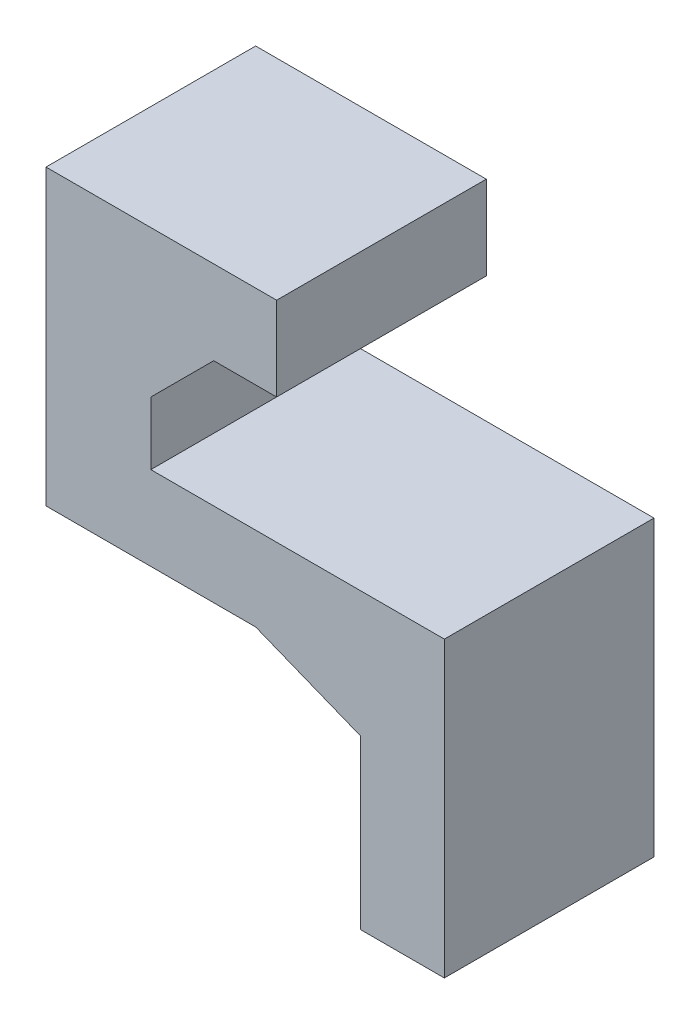
ISO-10303-21;
HEADER;
FILE_DESCRIPTION(('STEP AP214'),'2;1');
FILE_NAME('part.step','',(''),(''),'','','');
FILE_SCHEMA(('AUTOMOTIVE_DESIGN { 1 0 10303 214 1 1 1 1 }'));
ENDSEC;
DATA;
#1=APPLICATION_CONTEXT('core data for automotive mechanical design processes');
#2=APPLICATION_PROTOCOL_DEFINITION('international standard','automotive_design',2000,#1);
#3=PRODUCT_CONTEXT('',#1,'mechanical');
#4=PRODUCT('Part','Part','',(#3));
#5=PRODUCT_RELATED_PRODUCT_CATEGORY('part','',(#4));
#6=PRODUCT_DEFINITION_FORMATION('','',#4);
#7=PRODUCT_DEFINITION_CONTEXT('part definition',#1,'design');
#8=PRODUCT_DEFINITION('design','',#6,#7);
#9=PRODUCT_DEFINITION_SHAPE('','',#8);
#10=(LENGTH_UNIT() NAMED_UNIT(*) SI_UNIT(.MILLI.,.METRE.));
#11=(NAMED_UNIT(*) PLANE_ANGLE_UNIT() SI_UNIT($,.RADIAN.));
#12=(NAMED_UNIT(*) SI_UNIT($,.STERADIAN.) SOLID_ANGLE_UNIT());
#13=UNCERTAINTY_MEASURE_WITH_UNIT(LENGTH_MEASURE(1.E-05),#10,'distance_accuracy_value','');
#14=(GEOMETRIC_REPRESENTATION_CONTEXT(3) GLOBAL_UNCERTAINTY_ASSIGNED_CONTEXT((#13)) GLOBAL_UNIT_ASSIGNED_CONTEXT((#10,
#11,#12)) REPRESENTATION_CONTEXT('',''));
#15=CARTESIAN_POINT('',(0.,0.,0.));
#16=DIRECTION('',(0.,0.,1.));
#17=DIRECTION('',(1.,0.,0.));
#18=AXIS2_PLACEMENT_3D('',#15,#16,#17);
#19=CARTESIAN_POINT('',(-40.,120.,-50.));
#20=DIRECTION('',(-1.,0.,0.));
#21=DIRECTION('',(0.,-1.,0.));
#22=AXIS2_PLACEMENT_3D('',#19,#20,#21);
#23=PLANE('',#22);
#24=DIRECTION('',(0.,-1.,0.));
#25=VECTOR('',#24,1.);
#26=CARTESIAN_POINT('',(-40.,120.,0.));
#27=LINE('',#26,#25);
#28=CARTESIAN_POINT('',(-40.,120.,0.));
#29=VERTEX_POINT('',#28);
#30=CARTESIAN_POINT('',(-40.,100.,0.));
#31=VERTEX_POINT('',#30);
#32=EDGE_CURVE('E140',#29,#31,#27,.T.);
#33=ORIENTED_EDGE('',*,*,#32,.T.);
#34=DIRECTION('',(0.,0.,1.));
#35=VECTOR('',#34,1.);
#36=CARTESIAN_POINT('',(-40.,100.,-50.));
#37=LINE('',#36,#35);
#38=CARTESIAN_POINT('',(-40.,100.,-50.));
#39=VERTEX_POINT('',#38);
#40=EDGE_CURVE('E11',#39,#31,#37,.T.);
#41=ORIENTED_EDGE('',*,*,#40,.F.);
#42=DIRECTION('',(0.,-1.,0.));
#43=VECTOR('',#42,1.);
#44=CARTESIAN_POINT('',(-40.,120.,-50.));
#45=LINE('',#44,#43);
#46=CARTESIAN_POINT('',(-40.,120.,-50.));
#47=VERTEX_POINT('',#46);
#48=EDGE_CURVE('E128',#47,#39,#45,.T.);
#49=ORIENTED_EDGE('',*,*,#48,.F.);
#50=DIRECTION('',(0.,0.,1.));
#51=VECTOR('',#50,1.);
#52=CARTESIAN_POINT('',(-40.,120.,-50.));
#53=LINE('',#52,#51);
#54=EDGE_CURVE('E141',#47,#29,#53,.T.);
#55=ORIENTED_EDGE('',*,*,#54,.T.);
#56=EDGE_LOOP('',(#33,#41,#49,#55));
#57=FACE_BOUND('',#56,.T.);
#58=ADVANCED_FACE('F35',(#57),#23,.F.);
#59=CARTESIAN_POINT('',(-40.,100.,-50.));
#60=DIRECTION('',(0.,1.,0.));
#61=DIRECTION('',(0.,0.,1.));
#62=AXIS2_PLACEMENT_3D('',#59,#60,#61);
#63=PLANE('',#62);
#64=DIRECTION('',(-1.,0.,0.));
#65=VECTOR('',#64,1.);
#66=CARTESIAN_POINT('',(-40.,100.,0.));
#67=LINE('',#66,#65);
#68=CARTESIAN_POINT('',(-55.,100.,0.));
#69=VERTEX_POINT('',#68);
#70=EDGE_CURVE('E144',#31,#69,#67,.T.);
#71=ORIENTED_EDGE('',*,*,#70,.T.);
#72=DIRECTION('',(0.,0.,1.));
#73=VECTOR('',#72,1.);
#74=CARTESIAN_POINT('',(-55.,100.,-50.));
#75=LINE('',#74,#73);
#76=CARTESIAN_POINT('',(-55.,100.,-50.));
#77=VERTEX_POINT('',#76);
#78=EDGE_CURVE('E57',#77,#69,#75,.T.);
#79=ORIENTED_EDGE('',*,*,#78,.F.);
#80=DIRECTION('',(-1.,0.,0.));
#81=VECTOR('',#80,1.);
#82=CARTESIAN_POINT('',(-40.,100.,-50.));
#83=LINE('',#82,#81);
#84=EDGE_CURVE('E120',#39,#77,#83,.T.);
#85=ORIENTED_EDGE('',*,*,#84,.F.);
#86=ORIENTED_EDGE('',*,*,#40,.T.);
#87=EDGE_LOOP('',(#71,#79,#85,#86));
#88=FACE_BOUND('',#87,.T.);
#89=ADVANCED_FACE('F122',(#88),#63,.F.);
#90=CARTESIAN_POINT('',(-70.,100.,-50.));
#91=DIRECTION('',(-1.,0.,0.));
#92=DIRECTION('',(0.,0.,1.));
#93=AXIS2_PLACEMENT_3D('',#90,#91,#92);
#94=PLANE('',#93);
#95=DIRECTION('',(0.,-1.,0.));
#96=VECTOR('',#95,1.);
#97=CARTESIAN_POINT('',(-70.,100.,-50.));
#98=LINE('',#97,#96);
#99=CARTESIAN_POINT('',(-70.,84.9999999999999,-50.));
#100=VERTEX_POINT('',#99);
#101=CARTESIAN_POINT('',(-70.,70.,-50.));
#102=VERTEX_POINT('',#101);
#103=EDGE_CURVE('E49',#100,#102,#98,.T.);
#104=ORIENTED_EDGE('',*,*,#103,.F.);
#105=DIRECTION('',(0.,0.,1.));
#106=VECTOR('',#105,1.);
#107=CARTESIAN_POINT('',(-70.,85.,-50.));
#108=LINE('',#107,#106);
#109=CARTESIAN_POINT('',(-70.,84.9999999999999,0.));
#110=VERTEX_POINT('',#109);
#111=EDGE_CURVE('E239',#100,#110,#108,.T.);
#112=ORIENTED_EDGE('',*,*,#111,.T.);
#113=DIRECTION('',(0.,-1.,0.));
#114=VECTOR('',#113,1.);
#115=CARTESIAN_POINT('',(-70.,100.,0.));
#116=LINE('',#115,#114);
#117=CARTESIAN_POINT('',(-70.,70.,0.));
#118=VERTEX_POINT('',#117);
#119=EDGE_CURVE('E147',#110,#118,#116,.T.);
#120=ORIENTED_EDGE('',*,*,#119,.T.);
#121=DIRECTION('',(0.,0.,1.));
#122=VECTOR('',#121,1.);
#123=CARTESIAN_POINT('',(-70.,70.,-50.));
#124=LINE('',#123,#122);
#125=EDGE_CURVE('E42',#102,#118,#124,.T.);
#126=ORIENTED_EDGE('',*,*,#125,.F.);
#127=EDGE_LOOP('',(#104,#112,#120,#126));
#128=FACE_BOUND('',#127,.T.);
#129=ADVANCED_FACE('F250',(#128),#94,.F.);
#130=CARTESIAN_POINT('',(-70.,70.,-50.));
#131=DIRECTION('',(0.,-1.,0.));
#132=DIRECTION('',(0.,0.,-1.));
#133=AXIS2_PLACEMENT_3D('',#130,#131,#132);
#134=PLANE('',#133);
#135=DIRECTION('',(1.,0.,0.));
#136=VECTOR('',#135,1.);
#137=CARTESIAN_POINT('',(-70.,70.,0.));
#138=LINE('',#137,#136);
#139=CARTESIAN_POINT('',(0.,70.,0.));
#140=VERTEX_POINT('',#139);
#141=EDGE_CURVE('E156',#118,#140,#138,.T.);
#142=ORIENTED_EDGE('',*,*,#141,.T.);
#143=DIRECTION('',(0.,0.,1.));
#144=VECTOR('',#143,1.);
#145=CARTESIAN_POINT('',(0.,70.,-50.));
#146=LINE('',#145,#144);
#147=CARTESIAN_POINT('',(0.,70.,-50.));
#148=VERTEX_POINT('',#147);
#149=EDGE_CURVE('E182',#148,#140,#146,.T.);
#150=ORIENTED_EDGE('',*,*,#149,.F.);
#151=DIRECTION('',(1.,0.,0.));
#152=VECTOR('',#151,1.);
#153=CARTESIAN_POINT('',(-70.,70.,-50.));
#154=LINE('',#153,#152);
#155=EDGE_CURVE('E190',#102,#148,#154,.T.);
#156=ORIENTED_EDGE('',*,*,#155,.F.);
#157=ORIENTED_EDGE('',*,*,#125,.T.);
#158=EDGE_LOOP('',(#142,#150,#156,#157));
#159=FACE_BOUND('',#158,.T.);
#160=ADVANCED_FACE('F188',(#159),#134,.F.);
#161=CARTESIAN_POINT('',(0.,70.,-50.));
#162=DIRECTION('',(-1.,0.,0.));
#163=DIRECTION('',(0.,-1.,0.));
#164=AXIS2_PLACEMENT_3D('',#161,#162,#163);
#165=PLANE('',#164);
#166=DIRECTION('',(0.,-1.,0.));
#167=VECTOR('',#166,1.);
#168=CARTESIAN_POINT('',(0.,70.,0.));
#169=LINE('',#168,#167);
#170=CARTESIAN_POINT('',(0.,0.,0.));
#171=VERTEX_POINT('',#170);
#172=EDGE_CURVE('E158',#140,#171,#169,.T.);
#173=ORIENTED_EDGE('',*,*,#172,.T.);
#174=DIRECTION('',(0.,0.,1.));
#175=VECTOR('',#174,1.);
#176=CARTESIAN_POINT('',(0.,0.,-50.));
#177=LINE('',#176,#175);
#178=CARTESIAN_POINT('',(0.,0.,-50.));
#179=VERTEX_POINT('',#178);
#180=EDGE_CURVE('E179',#179,#171,#177,.T.);
#181=ORIENTED_EDGE('',*,*,#180,.F.);
#182=DIRECTION('',(0.,-1.,0.));
#183=VECTOR('',#182,1.);
#184=CARTESIAN_POINT('',(0.,70.,-50.));
#185=LINE('',#184,#183);
#186=EDGE_CURVE('E210',#148,#179,#185,.T.);
#187=ORIENTED_EDGE('',*,*,#186,.F.);
#188=ORIENTED_EDGE('',*,*,#149,.T.);
#189=EDGE_LOOP('',(#173,#181,#187,#188));
#190=FACE_BOUND('',#189,.T.);
#191=ADVANCED_FACE('F200',(#190),#165,.F.);
#192=CARTESIAN_POINT('',(0.,0.,-50.));
#193=DIRECTION('',(0.,1.,0.));
#194=DIRECTION('',(0.,0.,1.));
#195=AXIS2_PLACEMENT_3D('',#192,#193,#194);
#196=PLANE('',#195);
#197=DIRECTION('',(-1.,0.,0.));
#198=VECTOR('',#197,1.);
#199=CARTESIAN_POINT('',(0.,0.,0.));
#200=LINE('',#199,#198);
#201=CARTESIAN_POINT('',(-20.,0.,0.));
#202=VERTEX_POINT('',#201);
#203=EDGE_CURVE('E160',#171,#202,#200,.T.);
#204=ORIENTED_EDGE('',*,*,#203,.T.);
#205=DIRECTION('',(0.,0.,1.));
#206=VECTOR('',#205,1.);
#207=CARTESIAN_POINT('',(-20.,0.,-50.));
#208=LINE('',#207,#206);
#209=CARTESIAN_POINT('',(-20.,0.,-50.));
#210=VERTEX_POINT('',#209);
#211=EDGE_CURVE('E176',#210,#202,#208,.T.);
#212=ORIENTED_EDGE('',*,*,#211,.F.);
#213=DIRECTION('',(-1.,0.,0.));
#214=VECTOR('',#213,1.);
#215=CARTESIAN_POINT('',(0.,0.,-50.));
#216=LINE('',#215,#214);
#217=EDGE_CURVE('E206',#179,#210,#216,.T.);
#218=ORIENTED_EDGE('',*,*,#217,.F.);
#219=ORIENTED_EDGE('',*,*,#180,.T.);
#220=EDGE_LOOP('',(#204,#212,#218,#219));
#221=FACE_BOUND('',#220,.T.);
#222=ADVANCED_FACE('F204',(#221),#196,.F.);
#223=CARTESIAN_POINT('',(-20.,0.,-50.));
#224=DIRECTION('',(1.,0.,0.));
#225=DIRECTION('',(0.,0.,-1.));
#226=AXIS2_PLACEMENT_3D('',#223,#224,#225);
#227=PLANE('',#226);
#228=DIRECTION('',(0.,1.,0.));
#229=VECTOR('',#228,1.);
#230=CARTESIAN_POINT('',(-20.,0.,0.));
#231=LINE('',#230,#229);
#232=CARTESIAN_POINT('',(-20.,40.,0.));
#233=VERTEX_POINT('',#232);
#234=EDGE_CURVE('E162',#202,#233,#231,.T.);
#235=ORIENTED_EDGE('',*,*,#234,.T.);
#236=DIRECTION('',(0.,0.,1.));
#237=VECTOR('',#236,1.);
#238=CARTESIAN_POINT('',(-20.,40.,-50.));
#239=LINE('',#238,#237);
#240=CARTESIAN_POINT('',(-20.,40.,-50.));
#241=VERTEX_POINT('',#240);
#242=EDGE_CURVE('E145',#241,#233,#239,.T.);
#243=ORIENTED_EDGE('',*,*,#242,.F.);
#244=DIRECTION('',(0.,1.,0.));
#245=VECTOR('',#244,1.);
#246=CARTESIAN_POINT('',(-20.,0.,-50.));
#247=LINE('',#246,#245);
#248=EDGE_CURVE('E209',#210,#241,#247,.T.);
#249=ORIENTED_EDGE('',*,*,#248,.F.);
#250=ORIENTED_EDGE('',*,*,#211,.T.);
#251=EDGE_LOOP('',(#235,#243,#249,#250));
#252=FACE_BOUND('',#251,.T.);
#253=ADVANCED_FACE('F316',(#252),#227,.F.);
#254=CARTESIAN_POINT('',(-20.,50.,-50.));
#255=DIRECTION('',(0.,1.,0.));
#256=DIRECTION('',(-1.,0.,0.));
#257=AXIS2_PLACEMENT_3D('',#254,#255,#256);
#258=PLANE('',#257);
#259=DIRECTION('',(-1.,0.,0.));
#260=VECTOR('',#259,1.);
#261=CARTESIAN_POINT('',(-20.,50.,-50.));
#262=LINE('',#261,#260);
#263=CARTESIAN_POINT('',(-45.0000000000001,50.,-50.));
#264=VERTEX_POINT('',#263);
#265=CARTESIAN_POINT('',(-95.,50.,-50.));
#266=VERTEX_POINT('',#265);
#267=EDGE_CURVE('E212',#264,#266,#262,.T.);
#268=ORIENTED_EDGE('',*,*,#267,.F.);
#269=DIRECTION('',(0.,0.,1.));
#270=VECTOR('',#269,1.);
#271=CARTESIAN_POINT('',(-45.,50.,-50.));
#272=LINE('',#271,#270);
#273=CARTESIAN_POINT('',(-45.0000000000001,50.,0.));
#274=VERTEX_POINT('',#273);
#275=EDGE_CURVE('E150',#264,#274,#272,.T.);
#276=ORIENTED_EDGE('',*,*,#275,.T.);
#277=DIRECTION('',(-1.,0.,0.));
#278=VECTOR('',#277,1.);
#279=CARTESIAN_POINT('',(-20.,50.,0.));
#280=LINE('',#279,#278);
#281=CARTESIAN_POINT('',(-95.,50.,0.));
#282=VERTEX_POINT('',#281);
#283=EDGE_CURVE('E164',#274,#282,#280,.T.);
#284=ORIENTED_EDGE('',*,*,#283,.T.);
#285=DIRECTION('',(0.,0.,1.));
#286=VECTOR('',#285,1.);
#287=CARTESIAN_POINT('',(-95.,50.,-50.));
#288=LINE('',#287,#286);
#289=EDGE_CURVE('E173',#266,#282,#288,.T.);
#290=ORIENTED_EDGE('',*,*,#289,.F.);
#291=EDGE_LOOP('',(#268,#276,#284,#290));
#292=FACE_BOUND('',#291,.T.);
#293=ADVANCED_FACE('F313',(#292),#258,.F.);
#294=CARTESIAN_POINT('',(-95.,50.,-50.));
#295=DIRECTION('',(1.,0.,0.));
#296=DIRECTION('',(0.,0.,-1.));
#297=AXIS2_PLACEMENT_3D('',#294,#295,#296);
#298=PLANE('',#297);
#299=DIRECTION('',(0.,1.,0.));
#300=VECTOR('',#299,1.);
#301=CARTESIAN_POINT('',(-95.,50.,0.));
#302=LINE('',#301,#300);
#303=CARTESIAN_POINT('',(-95.,120.,0.));
#304=VERTEX_POINT('',#303);
#305=EDGE_CURVE('E166',#282,#304,#302,.T.);
#306=ORIENTED_EDGE('',*,*,#305,.T.);
#307=DIRECTION('',(0.,0.,1.));
#308=VECTOR('',#307,1.);
#309=CARTESIAN_POINT('',(-95.,120.,-50.));
#310=LINE('',#309,#308);
#311=CARTESIAN_POINT('',(-95.,120.,-50.));
#312=VERTEX_POINT('',#311);
#313=EDGE_CURVE('E170',#312,#304,#310,.T.);
#314=ORIENTED_EDGE('',*,*,#313,.F.);
#315=DIRECTION('',(0.,1.,0.));
#316=VECTOR('',#315,1.);
#317=CARTESIAN_POINT('',(-95.,50.,-50.));
#318=LINE('',#317,#316);
#319=EDGE_CURVE('E217',#266,#312,#318,.T.);
#320=ORIENTED_EDGE('',*,*,#319,.F.);
#321=ORIENTED_EDGE('',*,*,#289,.T.);
#322=EDGE_LOOP('',(#306,#314,#320,#321));
#323=FACE_BOUND('',#322,.T.);
#324=ADVANCED_FACE('F223',(#323),#298,.F.);
#325=CARTESIAN_POINT('',(-95.,120.,-50.));
#326=DIRECTION('',(0.,-1.,0.));
#327=DIRECTION('',(0.,0.,-1.));
#328=AXIS2_PLACEMENT_3D('',#325,#326,#327);
#329=PLANE('',#328);
#330=DIRECTION('',(1.,0.,0.));
#331=VECTOR('',#330,1.);
#332=CARTESIAN_POINT('',(-95.,120.,0.));
#333=LINE('',#332,#331);
#334=EDGE_CURVE('E137',#304,#29,#333,.T.);
#335=ORIENTED_EDGE('',*,*,#334,.T.);
#336=ORIENTED_EDGE('',*,*,#54,.F.);
#337=DIRECTION('',(1.,0.,0.));
#338=VECTOR('',#337,1.);
#339=CARTESIAN_POINT('',(-95.,120.,-50.));
#340=LINE('',#339,#338);
#341=EDGE_CURVE('E133',#312,#47,#340,.T.);
#342=ORIENTED_EDGE('',*,*,#341,.F.);
#343=ORIENTED_EDGE('',*,*,#313,.T.);
#344=EDGE_LOOP('',(#335,#336,#342,#343));
#345=FACE_BOUND('',#344,.T.);
#346=ADVANCED_FACE('F226',(#345),#329,.F.);
#347=CARTESIAN_POINT('',(0.,0.,-50.));
#348=DIRECTION('',(0.,0.,-1.));
#349=DIRECTION('',(-1.,0.,0.));
#350=AXIS2_PLACEMENT_3D('',#347,#348,#349);
#351=PLANE('',#350);
#352=DIRECTION('',(0.707106781186548,0.707106781186548,0.));
#353=VECTOR('',#352,1.);
#354=CARTESIAN_POINT('',(-77.5,77.5,-50.));
#355=LINE('',#354,#353);
#356=EDGE_CURVE('E244',#100,#77,#355,.T.);
#357=ORIENTED_EDGE('',*,*,#356,.F.);
#358=ORIENTED_EDGE('',*,*,#103,.T.);
#359=ORIENTED_EDGE('',*,*,#155,.T.);
#360=ORIENTED_EDGE('',*,*,#186,.T.);
#361=ORIENTED_EDGE('',*,*,#217,.T.);
#362=ORIENTED_EDGE('',*,*,#248,.T.);
#363=DIRECTION('',(0.928476690885259,-0.371390676354103,0.));
#364=VECTOR('',#363,1.);
#365=CARTESIAN_POINT('',(-45.,50.,-50.));
#366=LINE('',#365,#364);
#367=EDGE_CURVE('E236',#264,#241,#366,.T.);
#368=ORIENTED_EDGE('',*,*,#367,.F.);
#369=ORIENTED_EDGE('',*,*,#267,.T.);
#370=ORIENTED_EDGE('',*,*,#319,.T.);
#371=ORIENTED_EDGE('',*,*,#341,.T.);
#372=ORIENTED_EDGE('',*,*,#48,.T.);
#373=ORIENTED_EDGE('',*,*,#84,.T.);
#374=EDGE_LOOP('',(#357,#358,#359,#360,#361,#362,#368,#369,#370,#371,#372,#373));
#375=FACE_BOUND('',#374,.T.);
#376=ADVANCED_FACE('F131',(#375),#351,.T.);
#377=CARTESIAN_POINT('',(0.,0.,0.));
#378=DIRECTION('',(0.,0.,-1.));
#379=DIRECTION('',(-1.,0.,0.));
#380=AXIS2_PLACEMENT_3D('',#377,#378,#379);
#381=PLANE('',#380);
#382=ORIENTED_EDGE('',*,*,#119,.F.);
#383=DIRECTION('',(0.707106781186548,0.707106781186548,0.));
#384=VECTOR('',#383,1.);
#385=CARTESIAN_POINT('',(-77.5,77.5,0.));
#386=LINE('',#385,#384);
#387=EDGE_CURVE('E246',#110,#69,#386,.T.);
#388=ORIENTED_EDGE('',*,*,#387,.T.);
#389=ORIENTED_EDGE('',*,*,#70,.F.);
#390=ORIENTED_EDGE('',*,*,#32,.F.);
#391=ORIENTED_EDGE('',*,*,#334,.F.);
#392=ORIENTED_EDGE('',*,*,#305,.F.);
#393=ORIENTED_EDGE('',*,*,#283,.F.);
#394=DIRECTION('',(0.928476690885259,-0.371390676354103,0.));
#395=VECTOR('',#394,1.);
#396=CARTESIAN_POINT('',(-45.,50.,0.));
#397=LINE('',#396,#395);
#398=EDGE_CURVE('E230',#274,#233,#397,.T.);
#399=ORIENTED_EDGE('',*,*,#398,.T.);
#400=ORIENTED_EDGE('',*,*,#234,.F.);
#401=ORIENTED_EDGE('',*,*,#203,.F.);
#402=ORIENTED_EDGE('',*,*,#172,.F.);
#403=ORIENTED_EDGE('',*,*,#141,.F.);
#404=EDGE_LOOP('',(#382,#388,#389,#390,#391,#392,#393,#399,#400,#401,#402,#403));
#405=FACE_BOUND('',#404,.T.);
#406=ADVANCED_FACE('F193',(#405),#381,.F.);
#407=CARTESIAN_POINT('',(-45.,50.,-50.));
#408=DIRECTION('',(-0.371390676354104,-0.928476690885259,0.));
#409=DIRECTION('',(0.92847669088526,-0.371390676354104,0.));
#410=AXIS2_PLACEMENT_3D('',#407,#408,#409);
#411=PLANE('',#410);
#412=ORIENTED_EDGE('',*,*,#398,.F.);
#413=ORIENTED_EDGE('',*,*,#275,.F.);
#414=ORIENTED_EDGE('',*,*,#367,.T.);
#415=ORIENTED_EDGE('',*,*,#242,.T.);
#416=EDGE_LOOP('',(#412,#413,#414,#415));
#417=FACE_BOUND('',#416,.T.);
#418=ADVANCED_FACE('F234',(#417),#411,.T.);
#419=CARTESIAN_POINT('',(-77.5,77.5,-50.));
#420=DIRECTION('',(0.707106781186548,-0.707106781186548,0.));
#421=DIRECTION('',(0.707106781186548,0.707106781186548,0.));
#422=AXIS2_PLACEMENT_3D('',#419,#420,#421);
#423=PLANE('',#422);
#424=ORIENTED_EDGE('',*,*,#387,.F.);
#425=ORIENTED_EDGE('',*,*,#111,.F.);
#426=ORIENTED_EDGE('',*,*,#356,.T.);
#427=ORIENTED_EDGE('',*,*,#78,.T.);
#428=EDGE_LOOP('',(#424,#425,#426,#427));
#429=FACE_BOUND('',#428,.T.);
#430=ADVANCED_FACE('F249',(#429),#423,.T.);
#431=CLOSED_SHELL('',(#58,#89,#129,#160,#191,#222,#253,#293,#324,#346,#376,#406,#418,#430));
#432=MANIFOLD_SOLID_BREP('B2',#431);
#433=ADVANCED_BREP_SHAPE_REPRESENTATION('',(#18,#432),#14);
#434=SHAPE_DEFINITION_REPRESENTATION(#9,#433);
ENDSEC;
END-ISO-10303-21;
